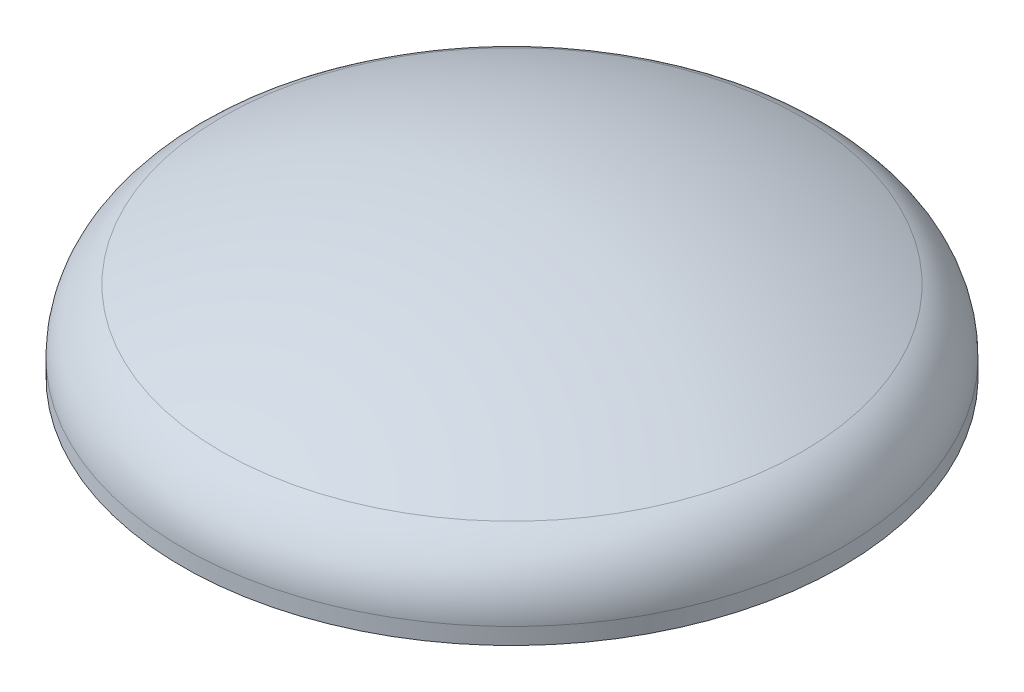
ISO-10303-21;
HEADER;
FILE_DESCRIPTION(('STEP AP214'),'2;1');
FILE_NAME('part.step','',(''),(''),'','','');
FILE_SCHEMA(('AUTOMOTIVE_DESIGN { 1 0 10303 214 1 1 1 1 }'));
ENDSEC;
DATA;
#1=APPLICATION_CONTEXT('core data for automotive mechanical design processes');
#2=APPLICATION_PROTOCOL_DEFINITION('international standard','automotive_design',2000,#1);
#3=PRODUCT_CONTEXT('',#1,'mechanical');
#4=PRODUCT('Part','Part','',(#3));
#5=PRODUCT_RELATED_PRODUCT_CATEGORY('part','',(#4));
#6=PRODUCT_DEFINITION_FORMATION('','',#4);
#7=PRODUCT_DEFINITION_CONTEXT('part definition',#1,'design');
#8=PRODUCT_DEFINITION('design','',#6,#7);
#9=PRODUCT_DEFINITION_SHAPE('','',#8);
#10=(LENGTH_UNIT() NAMED_UNIT(*) SI_UNIT(.MILLI.,.METRE.));
#11=(NAMED_UNIT(*) PLANE_ANGLE_UNIT() SI_UNIT($,.RADIAN.));
#12=(NAMED_UNIT(*) SI_UNIT($,.STERADIAN.) SOLID_ANGLE_UNIT());
#13=UNCERTAINTY_MEASURE_WITH_UNIT(LENGTH_MEASURE(1.E-05),#10,'distance_accuracy_value','');
#14=(GEOMETRIC_REPRESENTATION_CONTEXT(3) GLOBAL_UNCERTAINTY_ASSIGNED_CONTEXT((#13)) GLOBAL_UNIT_ASSIGNED_CONTEXT((#10,
#11,#12)) REPRESENTATION_CONTEXT('',''));
#15=CARTESIAN_POINT('',(0.,0.,0.));
#16=DIRECTION('',(0.,0.,1.));
#17=DIRECTION('',(1.,0.,0.));
#18=AXIS2_PLACEMENT_3D('',#15,#16,#17);
#19=CARTESIAN_POINT('',(-900.,0.,0.));
#20=DIRECTION('',(0.,1.,0.));
#21=DIRECTION('',(-1.,0.,0.));
#22=AXIS2_PLACEMENT_3D('',#19,#20,#21);
#23=PLANE('',#22);
#24=CARTESIAN_POINT('',(0.,2.54999489568221E-13,0.));
#25=DIRECTION('',(0.,-1.,0.));
#26=DIRECTION('',(1.,0.,0.));
#27=AXIS2_PLACEMENT_3D('',#24,#25,#26);
#28=CIRCLE('',#27,888.);
#29=CARTESIAN_POINT('',(888.,5.07794614897977E-13,0.));
#30=VERTEX_POINT('',#29);
#31=EDGE_CURVE('E56',#30,#30,#28,.T.);
#32=ORIENTED_EDGE('',*,*,#31,.F.);
#33=EDGE_LOOP('',(#32));
#34=FACE_BOUND('',#33,.T.);
#35=CARTESIAN_POINT('',(0.,2.5621127567205E-13,0.));
#36=DIRECTION('',(0.,-1.,0.));
#37=DIRECTION('',(1.,0.,0.));
#38=AXIS2_PLACEMENT_3D('',#35,#36,#37);
#39=CIRCLE('',#38,900.);
#40=CARTESIAN_POINT('',(900.,5.12422551344099E-13,0.));
#41=VERTEX_POINT('',#40);
#42=EDGE_CURVE('E10',#41,#41,#39,.T.);
#43=ORIENTED_EDGE('',*,*,#42,.T.);
#44=EDGE_LOOP('',(#43));
#45=FACE_BOUND('',#44,.T.);
#46=ADVANCED_FACE('F34',(#34,#45),#23,.F.);
#47=CARTESIAN_POINT('',(0.,0.,0.));
#48=DIRECTION('',(0.,-1.,0.));
#49=DIRECTION('',(1.,0.,0.));
#50=AXIS2_PLACEMENT_3D('',#47,#48,#49);
#51=CYLINDRICAL_SURFACE('',#50,900.);
#52=ORIENTED_EDGE('',*,*,#42,.F.);
#53=EDGE_LOOP('',(#52));
#54=FACE_BOUND('',#53,.T.);
#55=CARTESIAN_POINT('',(0.,45.0000000000003,0.));
#56=DIRECTION('',(0.,-1.,0.));
#57=DIRECTION('',(1.,0.,0.));
#58=AXIS2_PLACEMENT_3D('',#55,#56,#57);
#59=CIRCLE('',#58,900.);
#60=CARTESIAN_POINT('',(900.,45.0000000000005,0.));
#61=VERTEX_POINT('',#60);
#62=EDGE_CURVE('E40',#61,#61,#59,.T.);
#63=ORIENTED_EDGE('',*,*,#62,.T.);
#64=EDGE_LOOP('',(#63));
#65=FACE_BOUND('',#64,.T.);
#66=ADVANCED_FACE('F63',(#54,#65),#51,.T.);
#67=CARTESIAN_POINT('',(0.,45.0000000000002,0.));
#68=DIRECTION('',(0.,-1.,0.));
#69=DIRECTION('',(1.,0.,0.));
#70=AXIS2_PLACEMENT_3D('',#67,#68,#69);
#71=TOROIDAL_SURFACE('',#70,708.098281578947,191.901718421053);
#72=ORIENTED_EDGE('',*,*,#62,.F.);
#73=EDGE_LOOP('',(#72));
#74=FACE_BOUND('',#73,.T.);
#75=CARTESIAN_POINT('',(0.,217.60157065403,0.));
#76=DIRECTION('',(0.,-1.,0.));
#77=DIRECTION('',(1.,0.,0.));
#78=AXIS2_PLACEMENT_3D('',#75,#76,#77);
#79=CIRCLE('',#78,791.972993743669);
#80=CARTESIAN_POINT('',(791.972993743669,217.60157065403,0.));
#81=VERTEX_POINT('',#80);
#82=EDGE_CURVE('E44',#81,#81,#79,.T.);
#83=ORIENTED_EDGE('',*,*,#82,.T.);
#84=EDGE_LOOP('',(#83));
#85=FACE_BOUND('',#84,.T.);
#86=ADVANCED_FACE('F67',(#74,#85),#71,.T.);
#87=CARTESIAN_POINT('',(-1.11022302462516E-13,-1412.16,0.));
#88=DIRECTION('',(0.,-1.,0.));
#89=DIRECTION('',(1.,0.,0.));
#90=AXIS2_PLACEMENT_3D('',#87,#88,#89);
#91=SPHERICAL_SURFACE('',#90,1812.);
#92=ORIENTED_EDGE('',*,*,#82,.F.);
#93=EDGE_LOOP('',(#92));
#94=FACE_BOUND('',#93,.T.);
#95=ADVANCED_FACE('F72',(#94),#91,.T.);
#96=CARTESIAN_POINT('',(-1.11022302462516E-13,-1412.16,0.));
#97=DIRECTION('',(0.,-1.,0.));
#98=DIRECTION('',(-1.,0.,0.));
#99=AXIS2_PLACEMENT_3D('',#96,#97,#98);
#100=SPHERICAL_SURFACE('',#99,1800.);
#101=CARTESIAN_POINT('',(0.,206.808447669566,0.));
#102=DIRECTION('',(0.,-1.,0.));
#103=DIRECTION('',(1.,0.,0.));
#104=AXIS2_PLACEMENT_3D('',#101,#102,#103);
#105=CIRCLE('',#104,786.728139480466);
#106=CARTESIAN_POINT('',(786.728139480466,206.808447669567,0.));
#107=VERTEX_POINT('',#106);
#108=EDGE_CURVE('E48',#107,#107,#105,.T.);
#109=ORIENTED_EDGE('',*,*,#108,.T.);
#110=EDGE_LOOP('',(#109));
#111=FACE_BOUND('',#110,.T.);
#112=ADVANCED_FACE('F78',(#111),#100,.F.);
#113=CARTESIAN_POINT('',(0.,45.0000000000002,0.));
#114=DIRECTION('',(0.,-1.,0.));
#115=DIRECTION('',(1.,0.,0.));
#116=AXIS2_PLACEMENT_3D('',#113,#114,#115);
#117=TOROIDAL_SURFACE('',#116,708.098281578947,179.901718421053);
#118=ORIENTED_EDGE('',*,*,#108,.F.);
#119=EDGE_LOOP('',(#118));
#120=FACE_BOUND('',#119,.T.);
#121=CARTESIAN_POINT('',(0.,45.0000000000003,0.));
#122=DIRECTION('',(0.,-1.,0.));
#123=DIRECTION('',(1.,0.,0.));
#124=AXIS2_PLACEMENT_3D('',#121,#122,#123);
#125=CIRCLE('',#124,888.);
#126=CARTESIAN_POINT('',(888.,45.0000000000005,0.));
#127=VERTEX_POINT('',#126);
#128=EDGE_CURVE('E53',#127,#127,#125,.T.);
#129=ORIENTED_EDGE('',*,*,#128,.T.);
#130=EDGE_LOOP('',(#129));
#131=FACE_BOUND('',#130,.T.);
#132=ADVANCED_FACE('F82',(#120,#131),#117,.F.);
#133=CARTESIAN_POINT('',(0.,0.,0.));
#134=DIRECTION('',(0.,-1.,0.));
#135=DIRECTION('',(1.,0.,0.));
#136=AXIS2_PLACEMENT_3D('',#133,#134,#135);
#137=CYLINDRICAL_SURFACE('',#136,888.);
#138=ORIENTED_EDGE('',*,*,#128,.F.);
#139=EDGE_LOOP('',(#138));
#140=FACE_BOUND('',#139,.T.);
#141=ORIENTED_EDGE('',*,*,#31,.T.);
#142=EDGE_LOOP('',(#141));
#143=FACE_BOUND('',#142,.T.);
#144=ADVANCED_FACE('F60',(#140,#143),#137,.F.);
#145=CLOSED_SHELL('',(#46,#66,#86,#95,#112,#132,#144));
#146=MANIFOLD_SOLID_BREP('B2',#145);
#147=ADVANCED_BREP_SHAPE_REPRESENTATION('',(#18,#146),#14);
#148=SHAPE_DEFINITION_REPRESENTATION(#9,#147);
ENDSEC;
END-ISO-10303-21;
